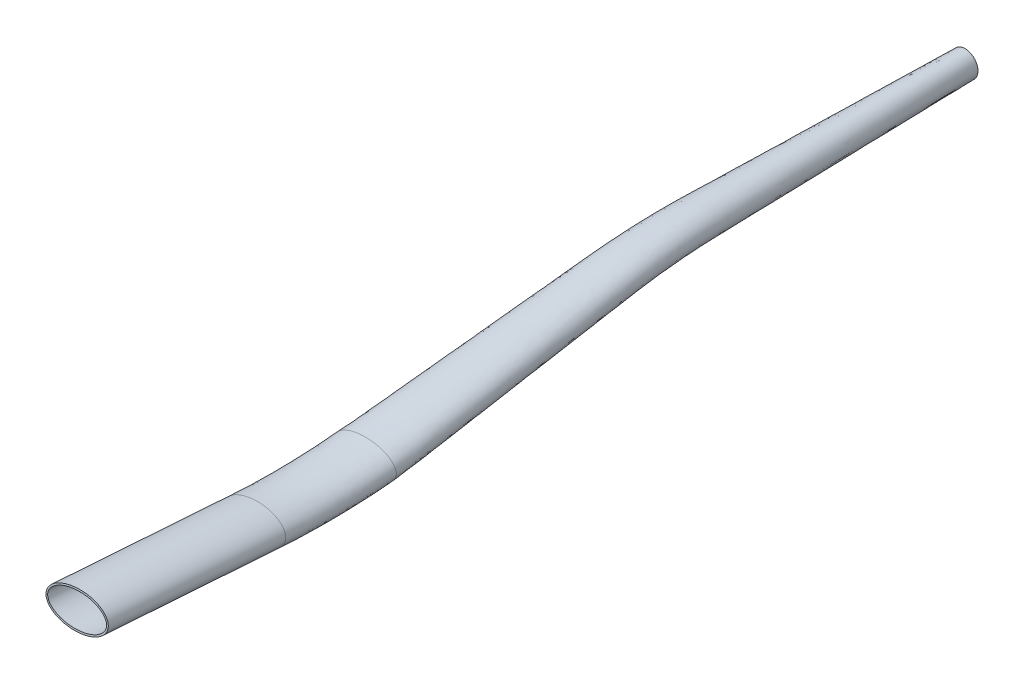
ISO-10303-21;
HEADER;
FILE_DESCRIPTION(('STEP AP214'),'2;1');
FILE_NAME('part.step','',(''),(''),'','','');
FILE_SCHEMA(('AUTOMOTIVE_DESIGN { 1 0 10303 214 1 1 1 1 }'));
ENDSEC;
DATA;
#1=APPLICATION_CONTEXT('core data for automotive mechanical design processes');
#2=APPLICATION_PROTOCOL_DEFINITION('international standard','automotive_design',2000,#1);
#3=PRODUCT_CONTEXT('',#1,'mechanical');
#4=PRODUCT('Part','Part','',(#3));
#5=PRODUCT_RELATED_PRODUCT_CATEGORY('part','',(#4));
#6=PRODUCT_DEFINITION_FORMATION('','',#4);
#7=PRODUCT_DEFINITION_CONTEXT('part definition',#1,'design');
#8=PRODUCT_DEFINITION('design','',#6,#7);
#9=PRODUCT_DEFINITION_SHAPE('','',#8);
#10=(LENGTH_UNIT() NAMED_UNIT(*) SI_UNIT(.MILLI.,.METRE.));
#11=(NAMED_UNIT(*) PLANE_ANGLE_UNIT() SI_UNIT($,.RADIAN.));
#12=(NAMED_UNIT(*) SI_UNIT($,.STERADIAN.) SOLID_ANGLE_UNIT());
#13=UNCERTAINTY_MEASURE_WITH_UNIT(LENGTH_MEASURE(1.E-05),#10,'distance_accuracy_value','');
#14=(GEOMETRIC_REPRESENTATION_CONTEXT(3) GLOBAL_UNCERTAINTY_ASSIGNED_CONTEXT((#13)) GLOBAL_UNIT_ASSIGNED_CONTEXT((#10,
#11,#12)) REPRESENTATION_CONTEXT('',''));
#15=CARTESIAN_POINT('',(0.,0.,0.));
#16=DIRECTION('',(0.,0.,1.));
#17=DIRECTION('',(1.,0.,0.));
#18=AXIS2_PLACEMENT_3D('',#15,#16,#17);
#19=CARTESIAN_POINT('',(15.,-19.392384035253,290.));
#20=CARTESIAN_POINT('',(15.,-21.1386962674885,307.808642376649));
#21=CARTESIAN_POINT('',(15.,-21.3886157486461,325.700956088542));
#22=CARTESIAN_POINT('',(15.,-20.1403892875166,343.55142612195));
#23=CARTESIAN_POINT('',(15.,-3.39238403525301,290.));
#24=CARTESIAN_POINT('',(15.,-5.13869626748848,306.913939423553));
#25=CARTESIAN_POINT('',(15.,-5.46348651872245,323.914688363784));
#26=CARTESIAN_POINT('',(15.,-4.36447637748164,340.882986155417));
#27=CARTESIAN_POINT('',(-15.,-3.39238403525301,290.));
#28=CARTESIAN_POINT('',(-15.,-5.13869626748848,306.913939423553));
#29=CARTESIAN_POINT('',(-15.,-5.46348651872245,323.914688363784));
#30=CARTESIAN_POINT('',(-15.,-4.36447637748164,340.882986155417));
#31=CARTESIAN_POINT('',(-15.,-19.392384035253,290.));
#32=CARTESIAN_POINT('',(-15.,-21.1386962674885,307.808642376649));
#33=CARTESIAN_POINT('',(-15.,-21.3886157486461,325.700956088542));
#34=CARTESIAN_POINT('',(-15.,-20.1403892875166,343.55142612195));
#35=CARTESIAN_POINT('',(-15.,-35.392384035253,290.));
#36=CARTESIAN_POINT('',(-15.,-37.1386962674885,308.703345329746));
#37=CARTESIAN_POINT('',(-15.,-37.3137449785697,327.4872238133));
#38=CARTESIAN_POINT('',(-15.,-35.9163021975516,346.219866088483));
#39=CARTESIAN_POINT('',(15.,-35.392384035253,290.));
#40=CARTESIAN_POINT('',(15.,-37.1386962674885,308.703345329746));
#41=CARTESIAN_POINT('',(15.,-37.3137449785697,327.4872238133));
#42=CARTESIAN_POINT('',(15.,-35.9163021975516,346.219866088483));
#43=CARTESIAN_POINT('',(15.,-19.392384035253,290.));
#44=CARTESIAN_POINT('',(15.,-21.1386962674885,307.808642376649));
#45=CARTESIAN_POINT('',(15.,-21.3886157486461,325.700956088542));
#46=CARTESIAN_POINT('',(15.,-20.1403892875166,343.55142612195));
#47=(BOUNDED_SURFACE() B_SPLINE_SURFACE(3,3,((#19,#20,#21,#22),(#23,#24,#25,#26),(#27,#28,#29,
#30),(#31,#32,#33,#34),(#35,#36,#37,#38),(#39,#40,#41,#42),(#43,#44,#45,#46)),.UNSPECIFIED.,.T.,
.F.,.F.) B_SPLINE_SURFACE_WITH_KNOTS((4,3,4),(4,4),(0.,0.5,1.),(0.,1.),
.UNSPECIFIED.) GEOMETRIC_REPRESENTATION_ITEM() RATIONAL_B_SPLINE_SURFACE(((1.,0.997661658599151,
0.997661658599151,1.),(0.333333333333333,0.332553886199717,0.332553886199717,0.333333333333333),
(0.333333333333333,0.332553886199717,0.332553886199717,0.333333333333333),(1.,0.997661658599151,
0.997661658599151,1.),(0.333333333333333,0.332553886199717,0.332553886199717,0.333333333333333),
(0.333333333333333,0.332553886199717,0.332553886199717,0.333333333333333),(1.,0.997661658599151,
0.997661658599151,1.))) REPRESENTATION_ITEM('') SURFACE());
#48=CARTESIAN_POINT('',(0.,-20.1403892875166,343.55142612195));
#49=DIRECTION('',(0.,0.16677749790832,0.985994556877187));
#50=DIRECTION('',(1.,0.,0.));
#51=AXIS2_PLACEMENT_3D('',#48,#49,#50);
#52=ELLIPSE('',#51,15.,8.);
#53=CARTESIAN_POINT('',(15.,-20.1403892875166,343.55142612195));
#54=VERTEX_POINT('',#53);
#55=EDGE_CURVE('E114',#54,#54,#52,.T.);
#56=CARTESIAN_POINT('',(0.,-19.392384035253,290.));
#57=DIRECTION('',(0.,0.,1.));
#58=DIRECTION('',(1.,0.,0.));
#59=AXIS2_PLACEMENT_3D('',#56,#57,#58);
#60=ELLIPSE('',#59,15.,8.);
#61=CARTESIAN_POINT('',(15.,-19.392384035253,290.));
#62=VERTEX_POINT('',#61);
#63=EDGE_CURVE('E121',#62,#62,#60,.T.);
#64=ORIENTED_EDGE('',*,*,#55,.F.);
#65=EDGE_LOOP('',(#64));
#66=FACE_BOUND('',#65,.T.);
#67=ORIENTED_EDGE('',*,*,#63,.T.);
#68=EDGE_LOOP('',(#67));
#69=FACE_BOUND('',#68,.T.);
#70=ADVANCED_FACE('F82',(#66,#69),#47,.T.);
#71=CARTESIAN_POINT('',(15.,-20.1403892875166,343.55142612195));
#72=CARTESIAN_POINT('',(15.,-14.1389075878283,429.376612954957));
#73=CARTESIAN_POINT('',(15.,-4.3644763774816,340.882986155417));
#74=CARTESIAN_POINT('',(15.,1.63700532220674,426.708172988424));
#75=CARTESIAN_POINT('',(-15.,-4.3644763774816,340.882986155417));
#76=CARTESIAN_POINT('',(-15.,1.63700532220674,426.708172988424));
#77=CARTESIAN_POINT('',(-15.,-20.1403892875166,343.55142612195));
#78=CARTESIAN_POINT('',(-15.,-14.1389075878283,429.376612954957));
#79=CARTESIAN_POINT('',(-15.,-35.9163021975516,346.219866088483));
#80=CARTESIAN_POINT('',(-15.,-29.9148204978633,432.04505292149));
#81=CARTESIAN_POINT('',(15.,-35.9163021975516,346.219866088483));
#82=CARTESIAN_POINT('',(15.,-29.9148204978633,432.04505292149));
#83=CARTESIAN_POINT('',(15.,-20.1403892875166,343.55142612195));
#84=CARTESIAN_POINT('',(15.,-14.1389075878283,429.376612954957));
#85=(BOUNDED_SURFACE() B_SPLINE_SURFACE(3,1,((#71,#72),(#73,#74),(#75,#76),(#77,#78),(#79,#80),
(#81,#82),(#83,#84)),.UNSPECIFIED.,.T.,.F.,.F.) B_SPLINE_SURFACE_WITH_KNOTS((4,3,4),(2,2),(0.,
0.5,1.),(0.,1.),.UNSPECIFIED.) GEOMETRIC_REPRESENTATION_ITEM() RATIONAL_B_SPLINE_SURFACE(((1.,
1.),(0.333333333333333,0.333333333333333),(0.333333333333333,0.333333333333333),(1.,1.),
(0.333333333333333,0.333333333333333),(0.333333333333333,0.333333333333333),(1.,1.))) REPRESENTATION_ITEM('') SURFACE());
#86=CARTESIAN_POINT('',(0.,-14.1389075878283,429.376612954957));
#87=DIRECTION('',(0.,0.166777497908316,0.985994556877188));
#88=DIRECTION('',(1.,0.,0.));
#89=AXIS2_PLACEMENT_3D('',#86,#87,#88);
#90=ELLIPSE('',#89,15.,8.);
#91=CARTESIAN_POINT('',(15.,-14.1389075878283,429.376612954957));
#92=VERTEX_POINT('',#91);
#93=EDGE_CURVE('E100',#92,#92,#90,.T.);
#94=ORIENTED_EDGE('',*,*,#93,.F.);
#95=EDGE_LOOP('',(#94));
#96=FACE_BOUND('',#95,.T.);
#97=ORIENTED_EDGE('',*,*,#55,.T.);
#98=EDGE_LOOP('',(#97));
#99=FACE_BOUND('',#98,.T.);
#100=ADVANCED_FACE('F84',(#96,#99),#85,.T.);
#101=CARTESIAN_POINT('',(0.,-14.1389075878283,429.376612954957));
#102=DIRECTION('',(0.,0.166777497908316,0.985994556877188));
#103=DIRECTION('',(1.,0.,0.));
#104=AXIS2_PLACEMENT_3D('',#101,#102,#103);
#105=PLANE('',#104);
#106=CARTESIAN_POINT('',(14.2,-14.1389075878283,429.376612954957));
#107=CARTESIAN_POINT('',(14.2,-13.2890683135953,429.232865642366));
#108=CARTESIAN_POINT('',(13.5825958033967,-11.5893897651293,428.945371017183));
#109=CARTESIAN_POINT('',(10.5191117895329,-9.12845318290115,428.529112283469));
#110=CARTESIAN_POINT('',(5.72174381584925,-7.44045498272719,428.243593347958));
#111=CARTESIAN_POINT('',(0.,-6.83939267610517,428.141925781047));
#112=CARTESIAN_POINT('',(-5.72174381584925,-7.44045498272719,428.243593347958));
#113=CARTESIAN_POINT('',(-10.5191117895329,-9.12845318290115,428.529112283469));
#114=CARTESIAN_POINT('',(-13.5825958033967,-11.5893897651293,428.945371017183));
#115=CARTESIAN_POINT('',(-14.5087020983016,-14.1389075878283,429.376612954957));
#116=CARTESIAN_POINT('',(-13.5825958033967,-16.6884254105272,429.807854892731));
#117=CARTESIAN_POINT('',(-10.5191117895329,-19.1493619927554,430.224113626446));
#118=CARTESIAN_POINT('',(-5.72174381584926,-20.8373601929293,430.509632561956));
#119=CARTESIAN_POINT('',(0.,-21.4384224995514,430.611300128868));
#120=CARTESIAN_POINT('',(5.72174381584925,-20.8373601929293,430.509632561956));
#121=CARTESIAN_POINT('',(10.5191117895329,-19.1493619927554,430.224113626446));
#122=CARTESIAN_POINT('',(13.5825958033967,-16.6884254105273,429.807854892731));
#123=CARTESIAN_POINT('',(14.2,-14.9887468620613,429.520360267549));
#124=CARTESIAN_POINT('',(14.2,-14.1389075878283,429.376612954957));
#125=B_SPLINE_CURVE_WITH_KNOTS('',3,(#106,#107,#108,#109,#110,#111,#112,#113,#114,#115,#116,
#117,#118,#119,#120,#121,#122,#123,#124),.UNSPECIFIED.,.T.,.F.,(4,1,1,1,1,1,1,1,1,1,1,1,1,1,1,1,
4),(0.,0.392699081698724,0.785398163397448,1.17809724509617,1.5707963267949,1.96349540849362,
2.35619449019234,2.74889357189107,3.14159265358979,3.53429173528852,3.92699081698724,
4.31968989868597,4.71238898038469,5.10508806208341,5.49778714378214,5.89048622548086,
6.28318530717959),.UNSPECIFIED.);
#126=CARTESIAN_POINT('',(14.2,-14.1389075878283,429.376612954957));
#127=VERTEX_POINT('',#126);
#128=EDGE_CURVE('E12',#127,#127,#125,.F.);
#129=ORIENTED_EDGE('',*,*,#128,.T.);
#130=EDGE_LOOP('',(#129));
#131=FACE_BOUND('',#130,.T.);
#132=ORIENTED_EDGE('',*,*,#93,.T.);
#133=EDGE_LOOP('',(#132));
#134=FACE_BOUND('',#133,.T.);
#135=ADVANCED_FACE('F197',(#131,#134),#105,.T.);
#136=CARTESIAN_POINT('',(14.2,-19.392384035253,290.));
#137=CARTESIAN_POINT('',(14.2,-21.1386962674885,307.808642376649));
#138=CARTESIAN_POINT('',(14.2,-21.3886157486461,325.700956088542));
#139=CARTESIAN_POINT('',(14.2,-20.1403892875166,343.55142612195));
#140=CARTESIAN_POINT('',(14.2,-20.2542947509922,290.));
#141=CARTESIAN_POINT('',(14.2,-22.0006069832277,307.856839505567));
#142=CARTESIAN_POINT('',(14.2,-22.2464932194463,325.797181294364));
#143=CARTESIAN_POINT('',(14.2,-20.9902285617496,343.695173434541));
#144=CARTESIAN_POINT('',(13.5825958033967,-21.9781161824707,290.));
#145=CARTESIAN_POINT('',(13.5825958033967,-23.7244284147062,307.953233763401));
#146=CARTESIAN_POINT('',(13.5825958033967,-23.9622481610466,325.989631706008));
#147=CARTESIAN_POINT('',(13.5825958033967,-22.6899071102156,343.982668059724));
#148=CARTESIAN_POINT('',(10.5191117895329,-24.4740088474589,290.));
#149=CARTESIAN_POINT('',(10.5191117895329,-26.2203210796944,308.092801422025));
#150=CARTESIAN_POINT('',(10.5191117895329,-26.4464614881689,326.268277488003));
#151=CARTESIAN_POINT('',(10.5191117895329,-25.1508436924437,344.398926793439));
#152=CARTESIAN_POINT('',(5.72174381584925,-26.1859840185188,290.));
#153=CARTESIAN_POINT('',(5.72174381584925,-27.9322962507543,308.188533249598));
#154=CARTESIAN_POINT('',(5.72174381584925,-28.1504256030158,326.459405362606));
#155=CARTESIAN_POINT('',(5.72174381584925,-26.8388418926177,344.684445728949));
#156=CARTESIAN_POINT('',(0.,-26.7955840436201,290.));
#157=CARTESIAN_POINT('',(0.,-28.5418962758556,308.222621433515));
#158=CARTESIAN_POINT('',(0.,-28.7571730516597,326.527462165722));
#159=CARTESIAN_POINT('',(0.,-27.4399041992397,344.78611329586));
#160=CARTESIAN_POINT('',(-5.72174381584926,-26.1859840185188,290.));
#161=CARTESIAN_POINT('',(-5.72174381584926,-27.9322962507543,308.188533249598));
#162=CARTESIAN_POINT('',(-5.72174381584926,-28.1504256030158,326.459405362606));
#163=CARTESIAN_POINT('',(-5.72174381584926,-26.8388418926177,344.684445728949));
#164=CARTESIAN_POINT('',(-10.5191117895329,-24.4740088474589,290.));
#165=CARTESIAN_POINT('',(-10.5191117895329,-26.2203210796944,308.092801422025));
#166=CARTESIAN_POINT('',(-10.5191117895329,-26.4464614881689,326.268277488003));
#167=CARTESIAN_POINT('',(-10.5191117895329,-25.1508436924437,344.398926793438));
#168=CARTESIAN_POINT('',(-13.5825958033967,-21.9781161824707,290.));
#169=CARTESIAN_POINT('',(-13.5825958033967,-23.7244284147061,307.953233763401));
#170=CARTESIAN_POINT('',(-13.5825958033967,-23.9622481610466,325.989631706008));
#171=CARTESIAN_POINT('',(-13.5825958033967,-22.6899071102156,343.982668059724));
#172=CARTESIAN_POINT('',(-14.5087020983016,-19.392384035253,290.));
#173=CARTESIAN_POINT('',(-14.5087020983016,-21.1386962674885,307.808642376649));
#174=CARTESIAN_POINT('',(-14.5087020983016,-21.3886157486461,325.700956088542));
#175=CARTESIAN_POINT('',(-14.5087020983016,-20.1403892875166,343.55142612195));
#176=CARTESIAN_POINT('',(-13.5825958033967,-16.8066518880353,290.));
#177=CARTESIAN_POINT('',(-13.5825958033967,-18.5529641202708,307.664050989897));
#178=CARTESIAN_POINT('',(-13.5825958033967,-18.8149833362455,325.412280471077));
#179=CARTESIAN_POINT('',(-13.5825958033967,-17.5908714648176,343.120184184176));
#180=CARTESIAN_POINT('',(-10.5191117895329,-14.3107592230471,290.));
#181=CARTESIAN_POINT('',(-10.5191117895329,-16.0570714552825,307.524483331274));
#182=CARTESIAN_POINT('',(-10.5191117895329,-16.3307700091232,325.133634689081));
#183=CARTESIAN_POINT('',(-10.5191117895329,-15.1299348825895,342.703925450461));
#184=CARTESIAN_POINT('',(-5.72174381584925,-12.5987840519872,290.));
#185=CARTESIAN_POINT('',(-5.72174381584925,-14.3450962842226,307.4287515037));
#186=CARTESIAN_POINT('',(-5.72174381584925,-14.6268058942763,324.942506814478));
#187=CARTESIAN_POINT('',(-5.72174381584925,-13.4419366824156,342.418406514951));
#188=CARTESIAN_POINT('',(0.,-11.9891840268859,290.));
#189=CARTESIAN_POINT('',(0.,-13.7354962591214,307.394663319784));
#190=CARTESIAN_POINT('',(0.,-14.0200584456325,324.874450011363));
#191=CARTESIAN_POINT('',(0.,-12.8408743757935,342.31673894804));
#192=CARTESIAN_POINT('',(5.72174381584925,-12.5987840519872,290.));
#193=CARTESIAN_POINT('',(5.72174381584925,-14.3450962842226,307.4287515037));
#194=CARTESIAN_POINT('',(5.72174381584925,-14.6268058942763,324.942506814478));
#195=CARTESIAN_POINT('',(5.72174381584925,-13.4419366824156,342.418406514951));
#196=CARTESIAN_POINT('',(10.5191117895329,-14.3107592230471,290.));
#197=CARTESIAN_POINT('',(10.5191117895329,-16.0570714552825,307.524483331274));
#198=CARTESIAN_POINT('',(10.5191117895329,-16.3307700091232,325.133634689081));
#199=CARTESIAN_POINT('',(10.5191117895329,-15.1299348825895,342.703925450461));
#200=CARTESIAN_POINT('',(13.5825958033967,-16.8066518880353,290.));
#201=CARTESIAN_POINT('',(13.5825958033967,-18.5529641202708,307.664050989897));
#202=CARTESIAN_POINT('',(13.5825958033967,-18.8149833362455,325.412280471077));
#203=CARTESIAN_POINT('',(13.5825958033967,-17.5908714648176,343.120184184176));
#204=CARTESIAN_POINT('',(14.2,-18.5304733195138,290.));
#205=CARTESIAN_POINT('',(14.2,-20.2767855517493,307.760445247732));
#206=CARTESIAN_POINT('',(14.2,-20.5307382778459,325.604730882721));
#207=CARTESIAN_POINT('',(14.2,-19.2905500132836,343.407678809359));
#208=CARTESIAN_POINT('',(14.2,-19.392384035253,290.));
#209=CARTESIAN_POINT('',(14.2,-21.1386962674885,307.808642376649));
#210=CARTESIAN_POINT('',(14.2,-21.3886157486461,325.700956088542));
#211=CARTESIAN_POINT('',(14.2,-20.1403892875166,343.55142612195));
#212=(BOUNDED_SURFACE() B_SPLINE_SURFACE(3,3,((#136,#137,#138,#139),(#140,#141,#142,#143),(#144,
#145,#146,#147),(#148,#149,#150,#151),(#152,#153,#154,#155),(#156,#157,#158,#159),(#160,#161,
#162,#163),(#164,#165,#166,#167),(#168,#169,#170,#171),(#172,#173,#174,#175),(#176,#177,#178,
#179),(#180,#181,#182,#183),(#184,#185,#186,#187),(#188,#189,#190,#191),(#192,#193,#194,#195),
(#196,#197,#198,#199),(#200,#201,#202,#203),(#204,#205,#206,#207),(#208,#209,#210,#211)),
.UNSPECIFIED.,.T.,.F.,.F.) B_SPLINE_SURFACE_WITH_KNOTS((4,1,1,1,1,1,1,1,1,1,1,1,1,1,1,1,4),(4,
4),(0.,0.0625000000000001,0.125,0.1875,0.25,0.3125,0.375,0.4375,0.5,0.5625,0.625,0.6875,0.75,
0.8125,0.875,0.9375,1.),(0.,1.),
.UNSPECIFIED.) GEOMETRIC_REPRESENTATION_ITEM() RATIONAL_B_SPLINE_SURFACE(((1.,0.997661658599151,
0.997661658599151,1.),(1.,0.997661658599151,0.997661658599151,1.),(1.,0.997661658599151,
0.997661658599151,1.),(1.,0.997661658599151,0.997661658599151,1.),(1.,0.997661658599151,
0.997661658599151,1.),(1.,0.997661658599151,0.997661658599151,1.),(1.,0.997661658599151,
0.997661658599151,1.),(1.,0.997661658599151,0.997661658599151,1.),(1.,0.997661658599151,
0.997661658599151,1.),(1.,0.997661658599151,0.997661658599151,1.),(1.,0.997661658599151,
0.997661658599151,1.),(1.,0.997661658599151,0.997661658599151,1.),(1.,0.997661658599151,
0.997661658599151,1.),(1.,0.997661658599151,0.997661658599151,1.),(1.,0.997661658599151,
0.997661658599151,1.),(1.,0.997661658599151,0.997661658599151,1.),(1.,0.997661658599151,
0.997661658599151,1.),(1.,0.997661658599151,0.997661658599151,1.),(1.,0.997661658599151,
0.997661658599151,1.))) REPRESENTATION_ITEM('') SURFACE());
#213=CARTESIAN_POINT('',(14.2,-20.1403892875166,343.55142612195));
#214=CARTESIAN_POINT('',(14.2,-19.2905500132836,343.407678809359));
#215=CARTESIAN_POINT('',(13.5825958033967,-17.5908714648176,343.120184184176));
#216=CARTESIAN_POINT('',(10.5191117895329,-15.1299348825895,342.703925450462));
#217=CARTESIAN_POINT('',(5.72174381584925,-13.4419366824155,342.418406514951));
#218=CARTESIAN_POINT('',(0.,-12.8408743757935,342.31673894804));
#219=CARTESIAN_POINT('',(-5.72174381584925,-13.4419366824155,342.418406514951));
#220=CARTESIAN_POINT('',(-10.5191117895329,-15.1299348825895,342.703925450462));
#221=CARTESIAN_POINT('',(-13.5825958033967,-17.5908714648176,343.120184184176));
#222=CARTESIAN_POINT('',(-14.5087020983016,-20.1403892875166,343.55142612195));
#223=CARTESIAN_POINT('',(-13.5825958033967,-22.6899071102156,343.982668059724));
#224=CARTESIAN_POINT('',(-10.5191117895329,-25.1508436924437,344.398926793439));
#225=CARTESIAN_POINT('',(-5.72174381584926,-26.8388418926176,344.684445728949));
#226=CARTESIAN_POINT('',(0.,-27.4399041992397,344.78611329586));
#227=CARTESIAN_POINT('',(5.72174381584925,-26.8388418926176,344.684445728949));
#228=CARTESIAN_POINT('',(10.5191117895329,-25.1508436924437,344.398926793439));
#229=CARTESIAN_POINT('',(13.5825958033967,-22.6899071102156,343.982668059724));
#230=CARTESIAN_POINT('',(14.2,-20.9902285617496,343.695173434542));
#231=CARTESIAN_POINT('',(14.2,-20.1403892875166,343.55142612195));
#232=B_SPLINE_CURVE_WITH_KNOTS('',3,(#213,#214,#215,#216,#217,#218,#219,#220,#221,#222,#223,
#224,#225,#226,#227,#228,#229,#230,#231),.UNSPECIFIED.,.T.,.F.,(4,1,1,1,1,1,1,1,1,1,1,1,1,1,1,1,
4),(0.,0.392699081698724,0.785398163397448,1.17809724509617,1.5707963267949,1.96349540849362,
2.35619449019234,2.74889357189107,3.14159265358979,3.53429173528852,3.92699081698724,
4.31968989868597,4.71238898038469,5.10508806208341,5.49778714378214,5.89048622548086,
6.28318530717959),.UNSPECIFIED.);
#233=CARTESIAN_POINT('',(14.2,-20.1403892875166,343.55142612195));
#234=VERTEX_POINT('',#233);
#235=EDGE_CURVE('E94',#234,#234,#232,.F.);
#236=CARTESIAN_POINT('',(14.2,-19.392384035253,290.));
#237=CARTESIAN_POINT('',(14.2,-18.5304733195138,290.));
#238=CARTESIAN_POINT('',(13.5825958033967,-16.8066518880353,290.));
#239=CARTESIAN_POINT('',(10.5191117895329,-14.3107592230471,290.));
#240=CARTESIAN_POINT('',(5.72174381584925,-12.5987840519872,290.));
#241=CARTESIAN_POINT('',(0.,-11.9891840268859,290.));
#242=CARTESIAN_POINT('',(-5.72174381584925,-12.5987840519872,290.));
#243=CARTESIAN_POINT('',(-10.5191117895329,-14.3107592230471,290.));
#244=CARTESIAN_POINT('',(-13.5825958033967,-16.8066518880353,290.));
#245=CARTESIAN_POINT('',(-14.5087020983016,-19.392384035253,290.));
#246=CARTESIAN_POINT('',(-13.5825958033967,-21.9781161824707,290.));
#247=CARTESIAN_POINT('',(-10.5191117895329,-24.4740088474589,290.));
#248=CARTESIAN_POINT('',(-5.72174381584926,-26.1859840185188,290.));
#249=CARTESIAN_POINT('',(0.,-26.7955840436201,290.));
#250=CARTESIAN_POINT('',(5.72174381584925,-26.1859840185188,290.));
#251=CARTESIAN_POINT('',(10.5191117895329,-24.4740088474589,290.));
#252=CARTESIAN_POINT('',(13.5825958033967,-21.9781161824707,290.));
#253=CARTESIAN_POINT('',(14.2,-20.2542947509922,290.));
#254=CARTESIAN_POINT('',(14.2,-19.392384035253,290.));
#255=B_SPLINE_CURVE_WITH_KNOTS('',3,(#236,#237,#238,#239,#240,#241,#242,#243,#244,#245,#246,
#247,#248,#249,#250,#251,#252,#253,#254),.UNSPECIFIED.,.T.,.F.,(4,1,1,1,1,1,1,1,1,1,1,1,1,1,1,1,
4),(0.,0.392699081698724,0.785398163397448,1.17809724509617,1.5707963267949,1.96349540849362,
2.35619449019234,2.74889357189107,3.14159265358979,3.53429173528852,3.92699081698724,
4.31968989868597,4.71238898038469,5.10508806208341,5.49778714378214,5.89048622548086,
6.28318530717959),.UNSPECIFIED.);
#256=CARTESIAN_POINT('',(14.2,-19.392384035253,290.));
#257=VERTEX_POINT('',#256);
#258=EDGE_CURVE('E117',#257,#257,#255,.F.);
#259=ORIENTED_EDGE('',*,*,#235,.F.);
#260=EDGE_LOOP('',(#259));
#261=FACE_BOUND('',#260,.T.);
#262=ORIENTED_EDGE('',*,*,#258,.T.);
#263=EDGE_LOOP('',(#262));
#264=FACE_BOUND('',#263,.T.);
#265=ADVANCED_FACE('F192',(#261,#264),#212,.T.);
#266=CARTESIAN_POINT('',(14.2,-20.1403892875166,343.55142612195));
#267=CARTESIAN_POINT('',(14.2,-14.1389075878283,429.376612954957));
#268=CARTESIAN_POINT('',(14.2,-20.9902285617496,343.695173434541));
#269=CARTESIAN_POINT('',(14.2,-14.9887468620613,429.520360267549));
#270=CARTESIAN_POINT('',(13.5825958033967,-22.6899071102156,343.982668059724));
#271=CARTESIAN_POINT('',(13.5825958033967,-16.6884254105272,429.807854892731));
#272=CARTESIAN_POINT('',(10.5191117895329,-25.1508436924437,344.398926793439));
#273=CARTESIAN_POINT('',(10.5191117895329,-19.1493619927554,430.224113626446));
#274=CARTESIAN_POINT('',(5.72174381584925,-26.8388418926177,344.684445728949));
#275=CARTESIAN_POINT('',(5.72174381584925,-20.8373601929293,430.509632561956));
#276=CARTESIAN_POINT('',(0.,-27.4399041992397,344.78611329586));
#277=CARTESIAN_POINT('',(0.,-21.4384224995514,430.611300128868));
#278=CARTESIAN_POINT('',(-5.72174381584926,-26.8388418926177,344.684445728949));
#279=CARTESIAN_POINT('',(-5.72174381584926,-20.8373601929293,430.509632561956));
#280=CARTESIAN_POINT('',(-10.5191117895329,-25.1508436924437,344.398926793439));
#281=CARTESIAN_POINT('',(-10.5191117895329,-19.1493619927554,430.224113626446));
#282=CARTESIAN_POINT('',(-13.5825958033967,-22.6899071102156,343.982668059724));
#283=CARTESIAN_POINT('',(-13.5825958033967,-16.6884254105272,429.807854892731));
#284=CARTESIAN_POINT('',(-14.5087020983016,-20.1403892875166,343.55142612195));
#285=CARTESIAN_POINT('',(-14.5087020983016,-14.1389075878283,429.376612954957));
#286=CARTESIAN_POINT('',(-13.5825958033967,-17.5908714648176,343.120184184176));
#287=CARTESIAN_POINT('',(-13.5825958033967,-11.5893897651293,428.945371017183));
#288=CARTESIAN_POINT('',(-10.5191117895329,-15.1299348825895,342.703925450462));
#289=CARTESIAN_POINT('',(-10.5191117895329,-9.12845318290115,428.529112283469));
#290=CARTESIAN_POINT('',(-5.72174381584925,-13.4419366824155,342.418406514951));
#291=CARTESIAN_POINT('',(-5.72174381584925,-7.44045498272718,428.243593347958));
#292=CARTESIAN_POINT('',(0.,-12.8408743757935,342.31673894804));
#293=CARTESIAN_POINT('',(0.,-6.83939267610516,428.141925781047));
#294=CARTESIAN_POINT('',(5.72174381584925,-13.4419366824155,342.418406514951));
#295=CARTESIAN_POINT('',(5.72174381584925,-7.44045498272718,428.243593347958));
#296=CARTESIAN_POINT('',(10.5191117895329,-15.1299348825895,342.703925450462));
#297=CARTESIAN_POINT('',(10.5191117895329,-9.12845318290114,428.529112283469));
#298=CARTESIAN_POINT('',(13.5825958033967,-17.5908714648176,343.120184184176));
#299=CARTESIAN_POINT('',(13.5825958033967,-11.5893897651293,428.945371017183));
#300=CARTESIAN_POINT('',(14.2,-19.2905500132836,343.407678809359));
#301=CARTESIAN_POINT('',(14.2,-13.2890683135953,429.232865642366));
#302=CARTESIAN_POINT('',(14.2,-20.1403892875166,343.55142612195));
#303=CARTESIAN_POINT('',(14.2,-14.1389075878283,429.376612954957));
#304=B_SPLINE_SURFACE_WITH_KNOTS('',3,1,((#266,#267),(#268,#269),(#270,#271),(#272,#273),(#274,
#275),(#276,#277),(#278,#279),(#280,#281),(#282,#283),(#284,#285),(#286,#287),(#288,#289),(#290,
#291),(#292,#293),(#294,#295),(#296,#297),(#298,#299),(#300,#301),(#302,#303)),.UNSPECIFIED.,
.T.,.F.,.F.,(4,1,1,1,1,1,1,1,1,1,1,1,1,1,1,1,4),(2,2),(0.,0.0625000000000001,0.125,0.1875,0.25,
0.3125,0.375,0.4375,0.5,0.5625,0.625,0.6875,0.75,0.8125,0.875,0.9375,1.),(0.,1.),.UNSPECIFIED.);
#305=ORIENTED_EDGE('',*,*,#128,.F.);
#306=EDGE_LOOP('',(#305));
#307=FACE_BOUND('',#306,.T.);
#308=ORIENTED_EDGE('',*,*,#235,.T.);
#309=EDGE_LOOP('',(#308));
#310=FACE_BOUND('',#309,.T.);
#311=ADVANCED_FACE('F190',(#307,#310),#304,.T.);
#312=CARTESIAN_POINT('',(0.,-19.392384035253,290.));
#313=DIRECTION('',(0.,0.,1.));
#314=DIRECTION('',(1.,0.,0.));
#315=AXIS2_PLACEMENT_3D('',#312,#313,#314);
#316=PLANE('',#315);
#317=ORIENTED_EDGE('',*,*,#258,.F.);
#318=EDGE_LOOP('',(#317));
#319=FACE_BOUND('',#318,.T.);
#320=ADVANCED_FACE('F158',(#319),#316,.T.);
#321=CARTESIAN_POINT('',(0.,0.,0.));
#322=DIRECTION('',(0.,0.,1.));
#323=DIRECTION('',(1.,0.,0.));
#324=AXIS2_PLACEMENT_3D('',#321,#322,#323);
#325=PLANE('',#324);
#326=CARTESIAN_POINT('',(0.,0.,0.));
#327=DIRECTION('',(0.,0.,1.));
#328=DIRECTION('',(1.,0.,0.));
#329=AXIS2_PLACEMENT_3D('',#326,#327,#328);
#330=CIRCLE('',#329,6.25);
#331=CARTESIAN_POINT('',(6.25,0.,0.));
#332=VERTEX_POINT('',#331);
#333=EDGE_CURVE('E125',#332,#332,#330,.T.);
#334=ORIENTED_EDGE('',*,*,#333,.F.);
#335=EDGE_LOOP('',(#334));
#336=FACE_BOUND('',#335,.T.);
#337=ADVANCED_FACE('F148',(#336),#325,.F.);
#338=CARTESIAN_POINT('',(-6.25,0.,0.));
#339=CARTESIAN_POINT('',(-7.53356888110141,0.,42.5411400593585));
#340=CARTESIAN_POINT('',(-8.81713776220287,-1.10154940724527E-13,85.0822801187178));
#341=CARTESIAN_POINT('',(-10.5497138306226,0.,142.50480124349));
#342=CARTESIAN_POINT('',(-10.9998094481987,-1.04313005325552,157.422255997444));
#343=CARTESIAN_POINT('',(-12.4958061929748,-8.01137040235698,207.003862395735));
#344=CARTESIAN_POINT('',(-13.5471654575138,-12.9085228020158,241.84891230617));
#345=CARTESIAN_POINT('',(-14.7319863429179,-18.4273293963225,281.117261650993));
#346=CARTESIAN_POINT('',(-14.8658701108036,-18.9564642368613,285.554552243775));
#347=CARTESIAN_POINT('',(-15.,-19.392384035253,290.));
#348=CARTESIAN_POINT('',(-6.25,-0.172473440600967,0.));
#349=CARTESIAN_POINT('',(-7.53356888110141,-0.179527721546262,42.5411400593585));
#350=CARTESIAN_POINT('',(-8.81713776220287,-0.186582002491665,85.0822801187178));
#351=CARTESIAN_POINT('',(-10.5497138306226,-0.196103952209739,142.50480124349));
#352=CARTESIAN_POINT('',(-10.9998094481987,-1.24170167423823,157.422255997444));
#353=CARTESIAN_POINT('',(-12.4958061929748,-8.21824457230503,207.003862395735));
#354=CARTESIAN_POINT('',(-13.5471654575138,-13.1212318521563,241.84891230617));
#355=CARTESIAN_POINT('',(-14.7319863429179,-18.6466140178674,281.117261650993));
#356=CARTESIAN_POINT('',(-14.8658701108036,-19.1764895496184,285.554552243775));
#357=CARTESIAN_POINT('',(-15.,-19.6131500392222,290.));
#358=CARTESIAN_POINT('',(-6.2359973440601,-0.514175633682709,0.));
#359=CARTESIAN_POINT('',(-7.516702634436,-0.535205766569164,42.5411400593585));
#360=CARTESIAN_POINT('',(-8.79740792481195,-0.556235899455728,85.0822801187178));
#361=CARTESIAN_POINT('',(-10.5261186854684,-0.584622615191077,142.50480124349));
#362=CARTESIAN_POINT('',(-10.9752125860068,-1.63510925129569,157.422255997444));
#363=CARTESIAN_POINT('',(-12.4678390223986,-8.62810105407349,207.003862395735));
#364=CARTESIAN_POINT('',(-13.516829695591,-13.5426483245596,241.84891230617));
#365=CARTESIAN_POINT('',(-14.6989813159864,-19.0810579289411,281.117261650993));
#366=CARTESIAN_POINT('',(-14.83256441021,-19.6124009087276,285.554552243775));
#367=CARTESIAN_POINT('',(-14.9663936257442,-20.0505288463669,290.));
#368=CARTESIAN_POINT('',(-6.17459908750349,-1.01538116377179,0.));
#369=CARTESIAN_POINT('',(-7.44274822576135,-1.05691094349235,42.5411400593585));
#370=CARTESIAN_POINT('',(-8.71089736401926,-1.09844072321303,85.0822801187178));
#371=CARTESIAN_POINT('',(-10.4226596858413,-1.15449809849674,142.50480124349));
#372=CARTESIAN_POINT('',(-10.8673612996633,-2.21215574731561,157.422255997444));
#373=CARTESIAN_POINT('',(-12.3452097496685,-9.22927464723233,207.003862395735));
#374=CARTESIAN_POINT('',(-13.3838147231908,-14.1607780021431,241.84891230617));
#375=CARTESIAN_POINT('',(-14.5542622626943,-19.7182961297846,281.117261650993));
#376=CARTESIAN_POINT('',(-14.686526975696,-20.2517915484063,285.554552243775));
#377=CARTESIAN_POINT('',(-14.8190378100084,-20.6920719248809,290.));
#378=CARTESIAN_POINT('',(-6.07442025347309,-1.50362523915437,0.));
#379=CARTESIAN_POINT('',(-7.32208247972989,-1.56512453340206,42.5411400593585));
#380=CARTESIAN_POINT('',(-8.56974470598673,-1.62662382764985,85.0822801187178));
#381=CARTESIAN_POINT('',(-10.2538535578848,-1.70963628378437,142.50480124349));
#382=CARTESIAN_POINT('',(-10.6913886137839,-2.77427949892691,157.422255997444));
#383=CARTESIAN_POINT('',(-12.1451249549355,-9.81490155578638,207.003862395735));
#384=CARTESIAN_POINT('',(-13.166784377527,-14.7629225013162,241.84891230617));
#385=CARTESIAN_POINT('',(-14.3181352644069,-20.3390549951426,281.117261650993));
#386=CARTESIAN_POINT('',(-14.4482488757158,-20.8746471893302,285.554552243775));
#387=CARTESIAN_POINT('',(-14.5786086083354,-21.3170243413706,290.));
#388=CARTESIAN_POINT('',(-5.25034595548562,-4.34563879217318,0.));
#389=CARTESIAN_POINT('',(-6.32948218731848,-4.52337837236559,42.5411400593585));
#390=CARTESIAN_POINT('',(-7.40861841915139,-4.7011179525581,85.0822801187178));
#391=CARTESIAN_POINT('',(-8.86524894156933,-4.94103288629188,142.50480124349));
#392=CARTESIAN_POINT('',(-9.2438316624123,-6.04633829308896,157.422255997444));
#393=CARTESIAN_POINT('',(-10.4992210236962,-13.2237695688164,207.003862395735));
#394=CARTESIAN_POINT('',(-11.3814858014763,-18.2679375415597,241.84891230617));
#395=CARTESIAN_POINT('',(-12.3757470121088,-23.9524221560685,281.117261650993));
#396=CARTESIAN_POINT('',(-12.4881655919818,-24.5002194437252,285.554552243775));
#397=CARTESIAN_POINT('',(-12.6008302931655,-24.9548016892347,290.));
#398=CARTESIAN_POINT('',(-2.7595750496155,-6.25,0.));
#399=CARTESIAN_POINT('',(-3.32934016670895,-6.50562924792629,42.5411400593585));
#400=CARTESIAN_POINT('',(-3.89910528380245,-6.76125849585269,85.0822801187178));
#401=CARTESIAN_POINT('',(-4.66818080521053,-7.10630980074647,142.50480124349));
#402=CARTESIAN_POINT('',(-4.86857963978305,-8.23886191096968,157.422255997444));
#403=CARTESIAN_POINT('',(-5.52446372838946,-15.5079655747505,207.003862395735));
#404=CARTESIAN_POINT('',(-5.98540711976242,-20.616559232121,241.84891230617));
#405=CARTESIAN_POINT('',(-6.50486357533206,-26.373647854867,281.117261650993));
#406=CARTESIAN_POINT('',(-6.56379878654926,-26.9296234661336,285.554552243775));
#407=CARTESIAN_POINT('',(-6.6229801190772,-27.392384035253,290.));
#408=CARTESIAN_POINT('',(3.44946881201937,-6.25,0.));
#409=CARTESIAN_POINT('',(4.14947426507879,-6.50562924792629,42.5411400593585));
#410=CARTESIAN_POINT('',(4.84947971813815,-6.76125849585269,85.0822801187178));
#411=CARTESIAN_POINT('',(5.7943551460107,-7.10630980074647,142.50480124349));
#412=CARTESIAN_POINT('',(6.03813669056594,-8.23886191096968,157.422255997444));
#413=CARTESIAN_POINT('',(6.87671141572014,-15.5079655747505,207.003862395735));
#414=CARTESIAN_POINT('',(7.46604645898005,-20.616559232121,241.84891230617));
#415=CARTESIAN_POINT('',(8.13019285622607,-26.373647854867,281.117261650993));
#416=CARTESIAN_POINT('',(8.20458206319165,-26.9296234661336,285.554552243775));
#417=CARTESIAN_POINT('',(8.2787251488465,-27.392384035253,290.));
#418=CARTESIAN_POINT('',(6.25,-3.44946881201938,0.));
#419=CARTESIAN_POINT('',(7.5227235981615,-3.59055443092525,42.5411400593585));
#420=CARTESIAN_POINT('',(8.79544719632296,-3.73164004983124,85.0822801187178));
#421=CARTESIAN_POINT('',(10.5133841768426,-3.9220790441956,142.50480124349));
#422=CARTESIAN_POINT('',(10.9575091289428,-5.0145624729098,157.422255997444));
#423=CARTESIAN_POINT('',(12.47014553096,-12.148853801318,207.003862395735));
#424=CARTESIAN_POINT('',(13.5331988435378,-17.1627038048249,241.84891230617));
#425=CARTESIAN_POINT('',(14.7311982425277,-22.8130218272222,281.117261650993));
#426=CARTESIAN_POINT('',(14.8657221819192,-23.3569704920036,285.554552243775));
#427=CARTESIAN_POINT('',(15.,-23.8077041146378,290.));
#428=CARTESIAN_POINT('',(6.25,3.44946881201937,0.));
#429=CARTESIAN_POINT('',(7.5227235981615,3.59055443092525,42.5411400593585));
#430=CARTESIAN_POINT('',(8.79544719632296,3.73164004983101,85.0822801187178));
#431=CARTESIAN_POINT('',(10.5133841768426,3.92207904419568,142.50480124349));
#432=CARTESIAN_POINT('',(10.9575091289428,2.92830236639876,157.422255997444));
#433=CARTESIAN_POINT('',(12.47014553096,-3.87388700339597,207.003862395735));
#434=CARTESIAN_POINT('',(13.5331988435378,-8.65434179920673,241.84891230617));
#435=CARTESIAN_POINT('',(14.7311982425277,-14.0416369654227,281.117261650993));
#436=CARTESIAN_POINT('',(14.8657221819192,-14.555957981719,285.554552243775));
#437=CARTESIAN_POINT('',(15.,-14.9770639558682,290.));
#438=CARTESIAN_POINT('',(3.44946881201938,6.25,0.));
#439=CARTESIAN_POINT('',(4.14947426507879,6.50562924792629,42.5411400593585));
#440=CARTESIAN_POINT('',(4.84947971813816,6.76125849585247,85.0822801187178));
#441=CARTESIAN_POINT('',(5.7943551460107,7.10630980074656,142.50480124349));
#442=CARTESIAN_POINT('',(6.03813669056594,6.15260180445864,157.422255997444));
#443=CARTESIAN_POINT('',(6.87671141572015,-0.514775229963504,207.003862395735));
#444=CARTESIAN_POINT('',(7.46604645898005,-5.20048637191067,241.84891230617));
#445=CARTESIAN_POINT('',(8.13019285622607,-10.4810109377779,281.117261650993));
#446=CARTESIAN_POINT('',(8.20458206319166,-10.983305007589,285.554552243775));
#447=CARTESIAN_POINT('',(8.2787251488465,-11.392384035253,290.));
#448=CARTESIAN_POINT('',(-2.7595750496155,6.25,0.));
#449=CARTESIAN_POINT('',(-3.32934016670895,6.50562924792629,42.5411400593585));
#450=CARTESIAN_POINT('',(-3.89910528380245,6.76125849585247,85.0822801187178));
#451=CARTESIAN_POINT('',(-4.66818080521053,7.10630980074656,142.50480124349));
#452=CARTESIAN_POINT('',(-4.86857963978304,6.15260180445864,157.422255997444));
#453=CARTESIAN_POINT('',(-5.52446372838946,-0.514775229963504,207.003862395735));
#454=CARTESIAN_POINT('',(-5.98540711976242,-5.20048637191067,241.84891230617));
#455=CARTESIAN_POINT('',(-6.50486357533205,-10.4810109377779,281.117261650993));
#456=CARTESIAN_POINT('',(-6.56379878654925,-10.983305007589,285.554552243775));
#457=CARTESIAN_POINT('',(-6.6229801190772,-11.392384035253,290.));
#458=CARTESIAN_POINT('',(-5.25034595548562,4.34563879217318,0.));
#459=CARTESIAN_POINT('',(-6.32948218731848,4.52337837236558,42.5411400593585));
#460=CARTESIAN_POINT('',(-7.40861841915139,4.70111795255788,85.0822801187178));
#461=CARTESIAN_POINT('',(-8.86524894156934,4.94103288629196,142.50480124349));
#462=CARTESIAN_POINT('',(-9.2438316624123,3.96007818657792,157.422255997444));
#463=CARTESIAN_POINT('',(-10.4992210236962,-2.79897123589758,207.003862395735));
#464=CARTESIAN_POINT('',(-11.3814858014763,-7.54910806247199,241.84891230617));
#465=CARTESIAN_POINT('',(-12.3757470121088,-12.9022366365764,281.117261650993));
#466=CARTESIAN_POINT('',(-12.4881655919818,-13.4127090299974,285.554552243775));
#467=CARTESIAN_POINT('',(-12.6008302931655,-13.8299663812713,290.));
#468=CARTESIAN_POINT('',(-6.07442025347309,1.50362523915438,0.));
#469=CARTESIAN_POINT('',(-7.32208247972989,1.56512453340206,42.5411400593585));
#470=CARTESIAN_POINT('',(-8.56974470598674,1.62662382764963,85.0822801187178));
#471=CARTESIAN_POINT('',(-10.2538535578848,1.70963628378445,142.50480124349));
#472=CARTESIAN_POINT('',(-10.6913886137839,0.688019392415872,157.422255997444));
#473=CARTESIAN_POINT('',(-12.1451249549355,-6.2078392489276,207.003862395735));
#474=CARTESIAN_POINT('',(-13.166784377527,-11.0541231027154,241.84891230617));
#475=CARTESIAN_POINT('',(-14.3181352644069,-16.5156037975023,281.117261650993));
#476=CARTESIAN_POINT('',(-14.4482488757158,-17.0382812843924,285.554552243775));
#477=CARTESIAN_POINT('',(-14.5786086083354,-17.4677437291354,290.));
#478=CARTESIAN_POINT('',(-6.17459908750349,1.01538116377179,0.));
#479=CARTESIAN_POINT('',(-7.44274822576135,1.05691094349235,42.5411400593585));
#480=CARTESIAN_POINT('',(-8.71089736401926,1.0984407232128,85.0822801187178));
#481=CARTESIAN_POINT('',(-10.4226596858413,1.15449809849682,142.50480124349));
#482=CARTESIAN_POINT('',(-10.8673612996633,0.125895640804568,157.422255997444));
#483=CARTESIAN_POINT('',(-12.3452097496685,-6.79346615748165,207.003862395735));
#484=CARTESIAN_POINT('',(-13.3838147231908,-11.6562676018886,241.84891230617));
#485=CARTESIAN_POINT('',(-14.5542622626943,-17.1363626628603,281.117261650993));
#486=CARTESIAN_POINT('',(-14.686526975696,-17.6611369253163,285.554552243775));
#487=CARTESIAN_POINT('',(-14.8190378100084,-18.0926961456251,290.));
#488=CARTESIAN_POINT('',(-6.2359973440601,0.514175633682714,0.));
#489=CARTESIAN_POINT('',(-7.516702634436,0.535205766569165,42.5411400593585));
#490=CARTESIAN_POINT('',(-8.79740792481195,0.556235899455508,85.0822801187178));
#491=CARTESIAN_POINT('',(-10.5261186854684,0.584622615191162,142.50480124349));
#492=CARTESIAN_POINT('',(-10.9752125860068,-0.451150855215353,157.422255997444));
#493=CARTESIAN_POINT('',(-12.4678390223986,-7.39463975064047,207.003862395735));
#494=CARTESIAN_POINT('',(-13.516829695591,-12.274397279472,241.84891230617));
#495=CARTESIAN_POINT('',(-14.6989813159864,-17.7736008637038,281.117261650993));
#496=CARTESIAN_POINT('',(-14.83256441021,-18.300527564995,285.554552243775));
#497=CARTESIAN_POINT('',(-14.9663936257442,-18.7342392241391,290.));
#498=CARTESIAN_POINT('',(-6.25,0.17247344060097,0.));
#499=CARTESIAN_POINT('',(-7.53356888110141,0.179527721546262,42.5411400593585));
#500=CARTESIAN_POINT('',(-8.81713776220287,0.186582002491445,85.0822801187178));
#501=CARTESIAN_POINT('',(-10.5497138306226,0.196103952209823,142.50480124349));
#502=CARTESIAN_POINT('',(-10.9998094481987,-0.844558432272807,157.422255997444));
#503=CARTESIAN_POINT('',(-12.4958061929748,-7.80449623240893,207.003862395735));
#504=CARTESIAN_POINT('',(-13.5471654575138,-12.6958137518754,241.84891230617));
#505=CARTESIAN_POINT('',(-14.7319863429179,-18.2080447747775,281.117261650993));
#506=CARTESIAN_POINT('',(-14.8658701108036,-18.7364389241042,285.554552243775));
#507=CARTESIAN_POINT('',(-15.,-19.1716180312838,290.));
#508=CARTESIAN_POINT('',(-6.25,0.,0.));
#509=CARTESIAN_POINT('',(-7.53356888110141,0.,42.5411400593585));
#510=CARTESIAN_POINT('',(-8.81713776220287,-1.10154940724527E-13,85.0822801187178));
#511=CARTESIAN_POINT('',(-10.5497138306226,0.,142.50480124349));
#512=CARTESIAN_POINT('',(-10.9998094481987,-1.04313005325552,157.422255997444));
#513=CARTESIAN_POINT('',(-12.4958061929748,-8.01137040235698,207.003862395735));
#514=CARTESIAN_POINT('',(-13.5471654575138,-12.9085228020158,241.84891230617));
#515=CARTESIAN_POINT('',(-14.7319863429179,-18.4273293963225,281.117261650993));
#516=CARTESIAN_POINT('',(-14.8658701108036,-18.9564642368613,285.554552243775));
#517=CARTESIAN_POINT('',(-15.,-19.392384035253,290.));
#518=B_SPLINE_SURFACE_WITH_KNOTS('',3,3,((#338,#339,#340,#341,#342,#343,#344,#345,#346,#347),
(#348,#349,#350,#351,#352,#353,#354,#355,#356,#357),(#358,#359,#360,#361,#362,#363,#364,#365,
#366,#367),(#368,#369,#370,#371,#372,#373,#374,#375,#376,#377),(#378,#379,#380,#381,#382,#383,
#384,#385,#386,#387),(#388,#389,#390,#391,#392,#393,#394,#395,#396,#397),(#398,#399,#400,#401,
#402,#403,#404,#405,#406,#407),(#408,#409,#410,#411,#412,#413,#414,#415,#416,#417),(#418,#419,
#420,#421,#422,#423,#424,#425,#426,#427),(#428,#429,#430,#431,#432,#433,#434,#435,#436,#437),
(#438,#439,#440,#441,#442,#443,#444,#445,#446,#447),(#448,#449,#450,#451,#452,#453,#454,#455,
#456,#457),(#458,#459,#460,#461,#462,#463,#464,#465,#466,#467),(#468,#469,#470,#471,#472,#473,
#474,#475,#476,#477),(#478,#479,#480,#481,#482,#483,#484,#485,#486,#487),(#488,#489,#490,#491,
#492,#493,#494,#495,#496,#497),(#498,#499,#500,#501,#502,#503,#504,#505,#506,#507),(#508,#509,
#510,#511,#512,#513,#514,#515,#516,#517)),.UNSPECIFIED.,.T.,.F.,.F.,(4,1,1,1,1,2,2,2,1,1,1,1,4),
(4,2,2,2,4),(0.,0.0125,0.0249999999999999,0.0375000000000001,0.05,0.25,0.5,0.75,0.95,0.9625,
0.975,0.9875,1.),(0.,0.438221567873642,0.591516522675314,0.953987250181054,1.),.UNSPECIFIED.);
#519=ORIENTED_EDGE('',*,*,#333,.T.);
#520=EDGE_LOOP('',(#519));
#521=FACE_BOUND('',#520,.T.);
#522=ORIENTED_EDGE('',*,*,#63,.F.);
#523=EDGE_LOOP('',(#522));
#524=FACE_BOUND('',#523,.T.);
#525=ADVANCED_FACE('F157',(#521,#524),#518,.T.);
#526=CLOSED_SHELL('',(#70,#100,#135,#265,#311,#320,#337,#525));
#527=MANIFOLD_SOLID_BREP('B2',#526);
#528=ADVANCED_BREP_SHAPE_REPRESENTATION('',(#18,#527),#14);
#529=SHAPE_DEFINITION_REPRESENTATION(#9,#528);
ENDSEC;
END-ISO-10303-21;
